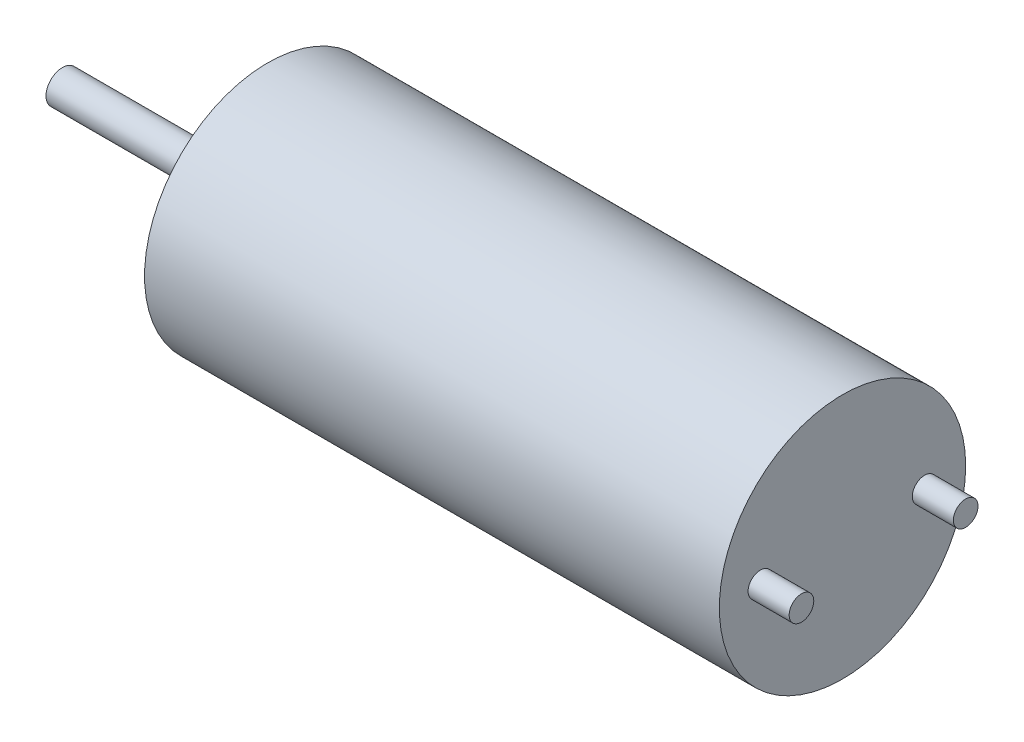
ISO-10303-21;
HEADER;
FILE_DESCRIPTION(('STEP AP214'),'2;1');
FILE_NAME('part.step','',(''),(''),'','','');
FILE_SCHEMA(('AUTOMOTIVE_DESIGN { 1 0 10303 214 1 1 1 1 }'));
ENDSEC;
DATA;
#1=APPLICATION_CONTEXT('core data for automotive mechanical design processes');
#2=APPLICATION_PROTOCOL_DEFINITION('international standard','automotive_design',2000,#1);
#3=PRODUCT_CONTEXT('',#1,'mechanical');
#4=PRODUCT('Part','Part','',(#3));
#5=PRODUCT_RELATED_PRODUCT_CATEGORY('part','',(#4));
#6=PRODUCT_DEFINITION_FORMATION('','',#4);
#7=PRODUCT_DEFINITION_CONTEXT('part definition',#1,'design');
#8=PRODUCT_DEFINITION('design','',#6,#7);
#9=PRODUCT_DEFINITION_SHAPE('','',#8);
#10=(LENGTH_UNIT() NAMED_UNIT(*) SI_UNIT(.MILLI.,.METRE.));
#11=(NAMED_UNIT(*) PLANE_ANGLE_UNIT() SI_UNIT($,.RADIAN.));
#12=(NAMED_UNIT(*) SI_UNIT($,.STERADIAN.) SOLID_ANGLE_UNIT());
#13=UNCERTAINTY_MEASURE_WITH_UNIT(LENGTH_MEASURE(1.E-05),#10,'distance_accuracy_value','');
#14=(GEOMETRIC_REPRESENTATION_CONTEXT(3) GLOBAL_UNCERTAINTY_ASSIGNED_CONTEXT((#13)) GLOBAL_UNIT_ASSIGNED_CONTEXT((#10,
#11,#12)) REPRESENTATION_CONTEXT('',''));
#15=CARTESIAN_POINT('',(0.,0.,0.));
#16=DIRECTION('',(0.,0.,1.));
#17=DIRECTION('',(1.,0.,0.));
#18=AXIS2_PLACEMENT_3D('',#15,#16,#17);
#19=CARTESIAN_POINT('',(14.,0.,0.));
#20=DIRECTION('',(-1.,0.,0.));
#21=DIRECTION('',(0.,0.,1.));
#22=AXIS2_PLACEMENT_3D('',#19,#20,#21);
#23=CYLINDRICAL_SURFACE('',#22,3.);
#24=CARTESIAN_POINT('',(14.,0.,0.));
#25=DIRECTION('',(1.,0.,0.));
#26=DIRECTION('',(0.,0.,-1.));
#27=AXIS2_PLACEMENT_3D('',#24,#25,#26);
#28=CIRCLE('',#27,3.);
#29=CARTESIAN_POINT('',(14.,0.,-3.));
#30=VERTEX_POINT('',#29);
#31=EDGE_CURVE('E47',#30,#30,#28,.T.);
#32=ORIENTED_EDGE('',*,*,#31,.F.);
#33=EDGE_LOOP('',(#32));
#34=FACE_BOUND('',#33,.T.);
#35=CARTESIAN_POINT('',(0.,0.,0.));
#36=DIRECTION('',(1.,0.,0.));
#37=DIRECTION('',(0.,0.,-1.));
#38=AXIS2_PLACEMENT_3D('',#35,#36,#37);
#39=CIRCLE('',#38,3.);
#40=CARTESIAN_POINT('',(0.,0.,-3.));
#41=VERTEX_POINT('',#40);
#42=EDGE_CURVE('E38',#41,#41,#39,.T.);
#43=ORIENTED_EDGE('',*,*,#42,.T.);
#44=EDGE_LOOP('',(#43));
#45=FACE_BOUND('',#44,.T.);
#46=ADVANCED_FACE('F35',(#34,#45),#23,.T.);
#47=CARTESIAN_POINT('',(14.,0.,0.));
#48=DIRECTION('',(1.,0.,0.));
#49=DIRECTION('',(0.,0.,-1.));
#50=AXIS2_PLACEMENT_3D('',#47,#48,#49);
#51=PLANE('',#50);
#52=CARTESIAN_POINT('',(14.,0.,-2.));
#53=DIRECTION('',(1.,0.,0.));
#54=DIRECTION('',(0.,0.,-1.));
#55=AXIS2_PLACEMENT_3D('',#52,#53,#54);
#56=CIRCLE('',#55,0.3);
#57=CARTESIAN_POINT('',(14.,0.,-2.3));
#58=VERTEX_POINT('',#57);
#59=EDGE_CURVE('E182',#58,#58,#56,.T.);
#60=ORIENTED_EDGE('',*,*,#59,.F.);
#61=EDGE_LOOP('',(#60));
#62=FACE_BOUND('',#61,.T.);
#63=CARTESIAN_POINT('',(14.,0.,2.));
#64=DIRECTION('',(1.,0.,0.));
#65=DIRECTION('',(0.,0.,-1.));
#66=AXIS2_PLACEMENT_3D('',#63,#64,#65);
#67=CIRCLE('',#66,0.3);
#68=CARTESIAN_POINT('',(14.,0.,1.7));
#69=VERTEX_POINT('',#68);
#70=EDGE_CURVE('E176',#69,#69,#67,.T.);
#71=ORIENTED_EDGE('',*,*,#70,.F.);
#72=EDGE_LOOP('',(#71));
#73=FACE_BOUND('',#72,.T.);
#74=ORIENTED_EDGE('',*,*,#31,.T.);
#75=EDGE_LOOP('',(#74));
#76=FACE_BOUND('',#75,.T.);
#77=ADVANCED_FACE('F65',(#62,#73,#76),#51,.T.);
#78=CARTESIAN_POINT('',(0.,0.,0.));
#79=DIRECTION('',(1.,0.,0.));
#80=DIRECTION('',(0.,0.,-1.));
#81=AXIS2_PLACEMENT_3D('',#78,#79,#80);
#82=PLANE('',#81);
#83=CARTESIAN_POINT('',(0.,0.,0.));
#84=DIRECTION('',(-1.,0.,0.));
#85=DIRECTION('',(0.,0.,1.));
#86=AXIS2_PLACEMENT_3D('',#83,#84,#85);
#87=CIRCLE('',#86,1.2);
#88=CARTESIAN_POINT('',(0.,0.,1.2));
#89=VERTEX_POINT('',#88);
#90=EDGE_CURVE('E42',#89,#89,#87,.T.);
#91=ORIENTED_EDGE('',*,*,#90,.F.);
#92=EDGE_LOOP('',(#91));
#93=FACE_BOUND('',#92,.T.);
#94=ORIENTED_EDGE('',*,*,#42,.F.);
#95=EDGE_LOOP('',(#94));
#96=FACE_BOUND('',#95,.T.);
#97=ADVANCED_FACE('F62',(#93,#96),#82,.F.);
#98=CARTESIAN_POINT('',(-0.8,0.,0.));
#99=DIRECTION('',(1.,0.,0.));
#100=DIRECTION('',(0.,0.,-1.));
#101=AXIS2_PLACEMENT_3D('',#98,#99,#100);
#102=CYLINDRICAL_SURFACE('',#101,1.2);
#103=CARTESIAN_POINT('',(-0.8,0.,0.));
#104=DIRECTION('',(-1.,0.,0.));
#105=DIRECTION('',(0.,0.,1.));
#106=AXIS2_PLACEMENT_3D('',#103,#104,#105);
#107=CIRCLE('',#106,1.2);
#108=CARTESIAN_POINT('',(-0.8,0.,1.2));
#109=VERTEX_POINT('',#108);
#110=EDGE_CURVE('E53',#109,#109,#107,.T.);
#111=ORIENTED_EDGE('',*,*,#110,.F.);
#112=EDGE_LOOP('',(#111));
#113=FACE_BOUND('',#112,.T.);
#114=ORIENTED_EDGE('',*,*,#90,.T.);
#115=EDGE_LOOP('',(#114));
#116=FACE_BOUND('',#115,.T.);
#117=ADVANCED_FACE('F64',(#113,#116),#102,.T.);
#118=CARTESIAN_POINT('',(-0.8,0.,0.));
#119=DIRECTION('',(-1.,0.,0.));
#120=DIRECTION('',(0.,0.,1.));
#121=AXIS2_PLACEMENT_3D('',#118,#119,#120);
#122=PLANE('',#121);
#123=CARTESIAN_POINT('',(-0.8,0.,0.));
#124=DIRECTION('',(-1.,0.,0.));
#125=DIRECTION('',(0.,0.,1.));
#126=AXIS2_PLACEMENT_3D('',#123,#124,#125);
#127=CIRCLE('',#126,0.4);
#128=CARTESIAN_POINT('',(-0.8,0.,0.4));
#129=VERTEX_POINT('',#128);
#130=EDGE_CURVE('E10',#129,#129,#127,.T.);
#131=ORIENTED_EDGE('',*,*,#130,.F.);
#132=EDGE_LOOP('',(#131));
#133=FACE_BOUND('',#132,.T.);
#134=ORIENTED_EDGE('',*,*,#110,.T.);
#135=EDGE_LOOP('',(#134));
#136=FACE_BOUND('',#135,.T.);
#137=ADVANCED_FACE('F71',(#133,#136),#122,.T.);
#138=CARTESIAN_POINT('',(-5.,0.,0.));
#139=DIRECTION('',(1.,0.,0.));
#140=DIRECTION('',(0.,0.,-1.));
#141=AXIS2_PLACEMENT_3D('',#138,#139,#140);
#142=CYLINDRICAL_SURFACE('',#141,0.4);
#143=CARTESIAN_POINT('',(-5.,0.,0.));
#144=DIRECTION('',(-1.,0.,0.));
#145=DIRECTION('',(0.,0.,1.));
#146=AXIS2_PLACEMENT_3D('',#143,#144,#145);
#147=CIRCLE('',#146,0.4);
#148=CARTESIAN_POINT('',(-5.,0.,0.4));
#149=VERTEX_POINT('',#148);
#150=EDGE_CURVE('E51',#149,#149,#147,.T.);
#151=ORIENTED_EDGE('',*,*,#150,.F.);
#152=EDGE_LOOP('',(#151));
#153=FACE_BOUND('',#152,.T.);
#154=ORIENTED_EDGE('',*,*,#130,.T.);
#155=EDGE_LOOP('',(#154));
#156=FACE_BOUND('',#155,.T.);
#157=ADVANCED_FACE('F139',(#153,#156),#142,.T.);
#158=CARTESIAN_POINT('',(-5.,0.,0.));
#159=DIRECTION('',(-1.,0.,0.));
#160=DIRECTION('',(0.,0.,1.));
#161=AXIS2_PLACEMENT_3D('',#158,#159,#160);
#162=PLANE('',#161);
#163=ORIENTED_EDGE('',*,*,#150,.T.);
#164=EDGE_LOOP('',(#163));
#165=FACE_BOUND('',#164,.T.);
#166=ADVANCED_FACE('F92',(#165),#162,.T.);
#167=CARTESIAN_POINT('',(15.,0.,2.));
#168=DIRECTION('',(-1.,0.,0.));
#169=DIRECTION('',(0.,0.,1.));
#170=AXIS2_PLACEMENT_3D('',#167,#168,#169);
#171=CYLINDRICAL_SURFACE('',#170,0.3);
#172=CARTESIAN_POINT('',(15.,0.,2.));
#173=DIRECTION('',(1.,0.,0.));
#174=DIRECTION('',(0.,0.,-1.));
#175=AXIS2_PLACEMENT_3D('',#172,#173,#174);
#176=CIRCLE('',#175,0.3);
#177=CARTESIAN_POINT('',(15.,0.,1.7));
#178=VERTEX_POINT('',#177);
#179=EDGE_CURVE('E174',#178,#178,#176,.T.);
#180=ORIENTED_EDGE('',*,*,#179,.F.);
#181=EDGE_LOOP('',(#180));
#182=FACE_BOUND('',#181,.T.);
#183=ORIENTED_EDGE('',*,*,#70,.T.);
#184=EDGE_LOOP('',(#183));
#185=FACE_BOUND('',#184,.T.);
#186=ADVANCED_FACE('F97',(#182,#185),#171,.T.);
#187=CARTESIAN_POINT('',(15.,0.,2.));
#188=DIRECTION('',(1.,0.,0.));
#189=DIRECTION('',(0.,0.,-1.));
#190=AXIS2_PLACEMENT_3D('',#187,#188,#189);
#191=PLANE('',#190);
#192=ORIENTED_EDGE('',*,*,#179,.T.);
#193=EDGE_LOOP('',(#192));
#194=FACE_BOUND('',#193,.T.);
#195=ADVANCED_FACE('F102',(#194),#191,.T.);
#196=CARTESIAN_POINT('',(15.,0.,-2.));
#197=DIRECTION('',(-1.,0.,0.));
#198=DIRECTION('',(0.,0.,1.));
#199=AXIS2_PLACEMENT_3D('',#196,#197,#198);
#200=CYLINDRICAL_SURFACE('',#199,0.3);
#201=CARTESIAN_POINT('',(15.,0.,-2.));
#202=DIRECTION('',(1.,0.,0.));
#203=DIRECTION('',(0.,0.,-1.));
#204=AXIS2_PLACEMENT_3D('',#201,#202,#203);
#205=CIRCLE('',#204,0.3);
#206=CARTESIAN_POINT('',(15.,0.,-2.3));
#207=VERTEX_POINT('',#206);
#208=EDGE_CURVE('E180',#207,#207,#205,.T.);
#209=ORIENTED_EDGE('',*,*,#208,.F.);
#210=EDGE_LOOP('',(#209));
#211=FACE_BOUND('',#210,.T.);
#212=ORIENTED_EDGE('',*,*,#59,.T.);
#213=EDGE_LOOP('',(#212));
#214=FACE_BOUND('',#213,.T.);
#215=ADVANCED_FACE('F112',(#211,#214),#200,.T.);
#216=CARTESIAN_POINT('',(15.,0.,-2.));
#217=DIRECTION('',(1.,0.,0.));
#218=DIRECTION('',(0.,0.,-1.));
#219=AXIS2_PLACEMENT_3D('',#216,#217,#218);
#220=PLANE('',#219);
#221=ORIENTED_EDGE('',*,*,#208,.T.);
#222=EDGE_LOOP('',(#221));
#223=FACE_BOUND('',#222,.T.);
#224=ADVANCED_FACE('F122',(#223),#220,.T.);
#225=CLOSED_SHELL('',(#46,#77,#97,#117,#137,#157,#166,#186,#195,#215,#224));
#226=MANIFOLD_SOLID_BREP('B2',#225);
#227=ADVANCED_BREP_SHAPE_REPRESENTATION('',(#18,#226),#14);
#228=SHAPE_DEFINITION_REPRESENTATION(#9,#227);
ENDSEC;
END-ISO-10303-21;
